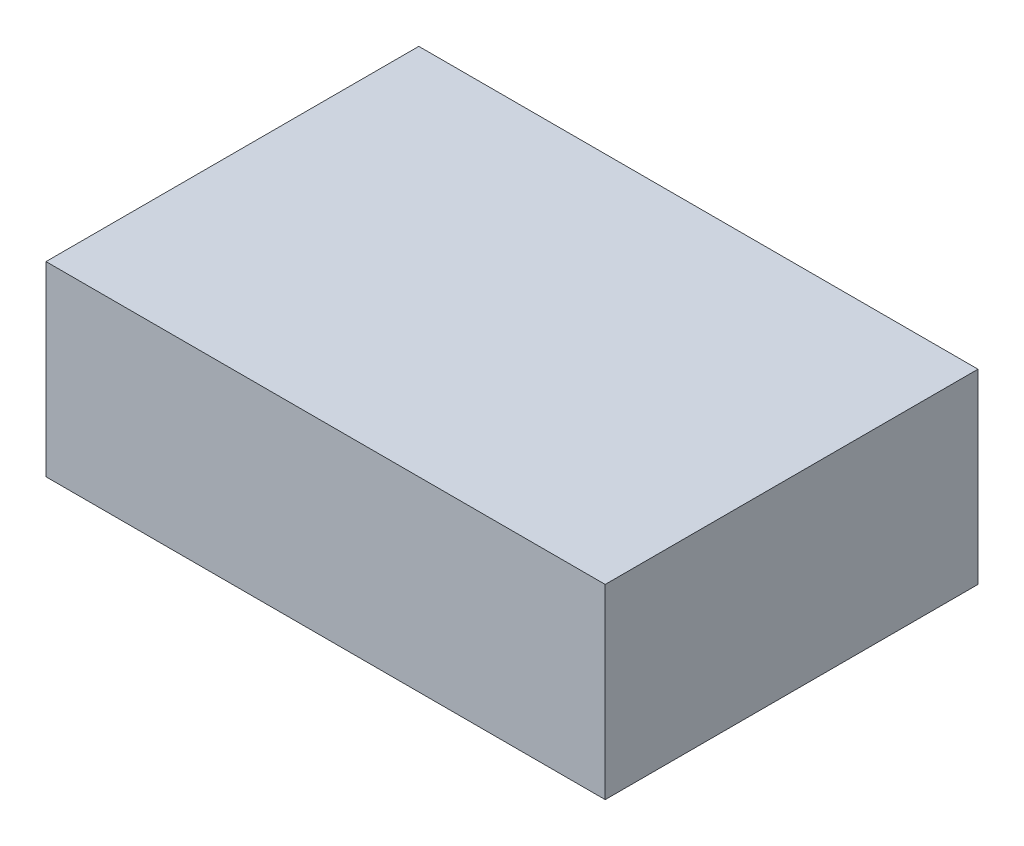
ISO-10303-21;
HEADER;
FILE_DESCRIPTION(('STEP AP214'),'2;1');
FILE_NAME('part.step','',(''),(''),'','','');
FILE_SCHEMA(('AUTOMOTIVE_DESIGN { 1 0 10303 214 1 1 1 1 }'));
ENDSEC;
DATA;
#1=APPLICATION_CONTEXT('core data for automotive mechanical design processes');
#2=APPLICATION_PROTOCOL_DEFINITION('international standard','automotive_design',2000,#1);
#3=PRODUCT_CONTEXT('',#1,'mechanical');
#4=PRODUCT('Part','Part','',(#3));
#5=PRODUCT_RELATED_PRODUCT_CATEGORY('part','',(#4));
#6=PRODUCT_DEFINITION_FORMATION('','',#4);
#7=PRODUCT_DEFINITION_CONTEXT('part definition',#1,'design');
#8=PRODUCT_DEFINITION('design','',#6,#7);
#9=PRODUCT_DEFINITION_SHAPE('','',#8);
#10=(LENGTH_UNIT() NAMED_UNIT(*) SI_UNIT(.MILLI.,.METRE.));
#11=(NAMED_UNIT(*) PLANE_ANGLE_UNIT() SI_UNIT($,.RADIAN.));
#12=(NAMED_UNIT(*) SI_UNIT($,.STERADIAN.) SOLID_ANGLE_UNIT());
#13=UNCERTAINTY_MEASURE_WITH_UNIT(LENGTH_MEASURE(1.E-05),#10,'distance_accuracy_value','');
#14=(GEOMETRIC_REPRESENTATION_CONTEXT(3) GLOBAL_UNCERTAINTY_ASSIGNED_CONTEXT((#13)) GLOBAL_UNIT_ASSIGNED_CONTEXT((#10,
#11,#12)) REPRESENTATION_CONTEXT('',''));
#15=CARTESIAN_POINT('',(0.,0.,0.));
#16=DIRECTION('',(0.,0.,1.));
#17=DIRECTION('',(1.,0.,0.));
#18=AXIS2_PLACEMENT_3D('',#15,#16,#17);
#19=CARTESIAN_POINT('',(-76.2,25.4,50.8));
#20=DIRECTION('',(1.,0.,0.));
#21=DIRECTION('',(0.,0.,-1.));
#22=AXIS2_PLACEMENT_3D('',#19,#20,#21);
#23=PLANE('',#22);
#24=DIRECTION('',(0.,0.,1.));
#25=VECTOR('',#24,1.);
#26=CARTESIAN_POINT('',(-76.2,-25.4,50.8));
#27=LINE('',#26,#25);
#28=CARTESIAN_POINT('',(-76.2,-25.4,-50.8));
#29=VERTEX_POINT('',#28);
#30=CARTESIAN_POINT('',(-76.2,-25.4,50.8));
#31=VERTEX_POINT('',#30);
#32=EDGE_CURVE('E98',#29,#31,#27,.T.);
#33=ORIENTED_EDGE('',*,*,#32,.T.);
#34=DIRECTION('',(0.,-1.,0.));
#35=VECTOR('',#34,1.);
#36=CARTESIAN_POINT('',(-76.2,25.4,50.8));
#37=LINE('',#36,#35);
#38=CARTESIAN_POINT('',(-76.2,25.4,50.8));
#39=VERTEX_POINT('',#38);
#40=EDGE_CURVE('E11',#39,#31,#37,.T.);
#41=ORIENTED_EDGE('',*,*,#40,.F.);
#42=DIRECTION('',(0.,0.,1.));
#43=VECTOR('',#42,1.);
#44=CARTESIAN_POINT('',(-76.2,25.4,50.8));
#45=LINE('',#44,#43);
#46=CARTESIAN_POINT('',(-76.2,25.4,-50.8));
#47=VERTEX_POINT('',#46);
#48=EDGE_CURVE('E86',#47,#39,#45,.T.);
#49=ORIENTED_EDGE('',*,*,#48,.F.);
#50=DIRECTION('',(0.,-1.,0.));
#51=VECTOR('',#50,1.);
#52=CARTESIAN_POINT('',(-76.2,25.4,-50.8));
#53=LINE('',#52,#51);
#54=EDGE_CURVE('E94',#47,#29,#53,.T.);
#55=ORIENTED_EDGE('',*,*,#54,.T.);
#56=EDGE_LOOP('',(#33,#41,#49,#55));
#57=FACE_BOUND('',#56,.T.);
#58=ADVANCED_FACE('F35',(#57),#23,.F.);
#59=CARTESIAN_POINT('',(76.2,25.4,50.8));
#60=DIRECTION('',(0.,0.,-1.));
#61=DIRECTION('',(-1.,0.,0.));
#62=AXIS2_PLACEMENT_3D('',#59,#60,#61);
#63=PLANE('',#62);
#64=DIRECTION('',(1.,0.,0.));
#65=VECTOR('',#64,1.);
#66=CARTESIAN_POINT('',(76.2,-25.4,50.8));
#67=LINE('',#66,#65);
#68=CARTESIAN_POINT('',(76.2,-25.4,50.8));
#69=VERTEX_POINT('',#68);
#70=EDGE_CURVE('E90',#31,#69,#67,.T.);
#71=ORIENTED_EDGE('',*,*,#70,.T.);
#72=DIRECTION('',(0.,-1.,0.));
#73=VECTOR('',#72,1.);
#74=CARTESIAN_POINT('',(76.2,25.4,50.8));
#75=LINE('',#74,#73);
#76=CARTESIAN_POINT('',(76.2,25.4,50.8));
#77=VERTEX_POINT('',#76);
#78=EDGE_CURVE('E43',#77,#69,#75,.T.);
#79=ORIENTED_EDGE('',*,*,#78,.F.);
#80=DIRECTION('',(1.,0.,0.));
#81=VECTOR('',#80,1.);
#82=CARTESIAN_POINT('',(76.2,25.4,50.8));
#83=LINE('',#82,#81);
#84=EDGE_CURVE('E81',#39,#77,#83,.T.);
#85=ORIENTED_EDGE('',*,*,#84,.F.);
#86=ORIENTED_EDGE('',*,*,#40,.T.);
#87=EDGE_LOOP('',(#71,#79,#85,#86));
#88=FACE_BOUND('',#87,.T.);
#89=ADVANCED_FACE('F89',(#88),#63,.F.);
#90=CARTESIAN_POINT('',(76.2,25.4,50.8));
#91=DIRECTION('',(-1.,0.,0.));
#92=DIRECTION('',(0.,0.,1.));
#93=AXIS2_PLACEMENT_3D('',#90,#91,#92);
#94=PLANE('',#93);
#95=DIRECTION('',(0.,0.,-1.));
#96=VECTOR('',#95,1.);
#97=CARTESIAN_POINT('',(76.2,-25.4,50.8));
#98=LINE('',#97,#96);
#99=CARTESIAN_POINT('',(76.2,-25.4,-50.8));
#100=VERTEX_POINT('',#99);
#101=EDGE_CURVE('E68',#69,#100,#98,.T.);
#102=ORIENTED_EDGE('',*,*,#101,.T.);
#103=DIRECTION('',(0.,-1.,0.));
#104=VECTOR('',#103,1.);
#105=CARTESIAN_POINT('',(76.2,25.4,-50.8));
#106=LINE('',#105,#104);
#107=CARTESIAN_POINT('',(76.2,25.4,-50.8));
#108=VERTEX_POINT('',#107);
#109=EDGE_CURVE('E91',#108,#100,#106,.T.);
#110=ORIENTED_EDGE('',*,*,#109,.F.);
#111=DIRECTION('',(0.,0.,-1.));
#112=VECTOR('',#111,1.);
#113=CARTESIAN_POINT('',(76.2,25.4,50.8));
#114=LINE('',#113,#112);
#115=EDGE_CURVE('E84',#77,#108,#114,.T.);
#116=ORIENTED_EDGE('',*,*,#115,.F.);
#117=ORIENTED_EDGE('',*,*,#78,.T.);
#118=EDGE_LOOP('',(#102,#110,#116,#117));
#119=FACE_BOUND('',#118,.T.);
#120=ADVANCED_FACE('F92',(#119),#94,.F.);
#121=CARTESIAN_POINT('',(76.2,25.4,-50.8));
#122=DIRECTION('',(0.,0.,1.));
#123=DIRECTION('',(1.,0.,0.));
#124=AXIS2_PLACEMENT_3D('',#121,#122,#123);
#125=PLANE('',#124);
#126=DIRECTION('',(-1.,0.,0.));
#127=VECTOR('',#126,1.);
#128=CARTESIAN_POINT('',(76.2,-25.4,-50.8));
#129=LINE('',#128,#127);
#130=EDGE_CURVE('E74',#100,#29,#129,.T.);
#131=ORIENTED_EDGE('',*,*,#130,.T.);
#132=ORIENTED_EDGE('',*,*,#54,.F.);
#133=DIRECTION('',(-1.,0.,0.));
#134=VECTOR('',#133,1.);
#135=CARTESIAN_POINT('',(76.2,25.4,-50.8));
#136=LINE('',#135,#134);
#137=EDGE_CURVE('E51',#108,#47,#136,.T.);
#138=ORIENTED_EDGE('',*,*,#137,.F.);
#139=ORIENTED_EDGE('',*,*,#109,.T.);
#140=EDGE_LOOP('',(#131,#132,#138,#139));
#141=FACE_BOUND('',#140,.T.);
#142=ADVANCED_FACE('F105',(#141),#125,.F.);
#143=CARTESIAN_POINT('',(0.,25.4,0.));
#144=DIRECTION('',(0.,1.,0.));
#145=DIRECTION('',(0.,0.,1.));
#146=AXIS2_PLACEMENT_3D('',#143,#144,#145);
#147=PLANE('',#146);
#148=ORIENTED_EDGE('',*,*,#48,.T.);
#149=ORIENTED_EDGE('',*,*,#84,.T.);
#150=ORIENTED_EDGE('',*,*,#115,.T.);
#151=ORIENTED_EDGE('',*,*,#137,.T.);
#152=EDGE_LOOP('',(#148,#149,#150,#151));
#153=FACE_BOUND('',#152,.T.);
#154=ADVANCED_FACE('F82',(#153),#147,.T.);
#155=CARTESIAN_POINT('',(0.,-25.4,0.));
#156=DIRECTION('',(0.,1.,0.));
#157=DIRECTION('',(0.,0.,1.));
#158=AXIS2_PLACEMENT_3D('',#155,#156,#157);
#159=PLANE('',#158);
#160=ORIENTED_EDGE('',*,*,#32,.F.);
#161=ORIENTED_EDGE('',*,*,#130,.F.);
#162=ORIENTED_EDGE('',*,*,#101,.F.);
#163=ORIENTED_EDGE('',*,*,#70,.F.);
#164=EDGE_LOOP('',(#160,#161,#162,#163));
#165=FACE_BOUND('',#164,.T.);
#166=ADVANCED_FACE('F108',(#165),#159,.F.);
#167=CLOSED_SHELL('',(#58,#89,#120,#142,#154,#166));
#168=MANIFOLD_SOLID_BREP('B2',#167);
#169=ADVANCED_BREP_SHAPE_REPRESENTATION('',(#18,#168),#14);
#170=SHAPE_DEFINITION_REPRESENTATION(#9,#169);
ENDSEC;
END-ISO-10303-21;
